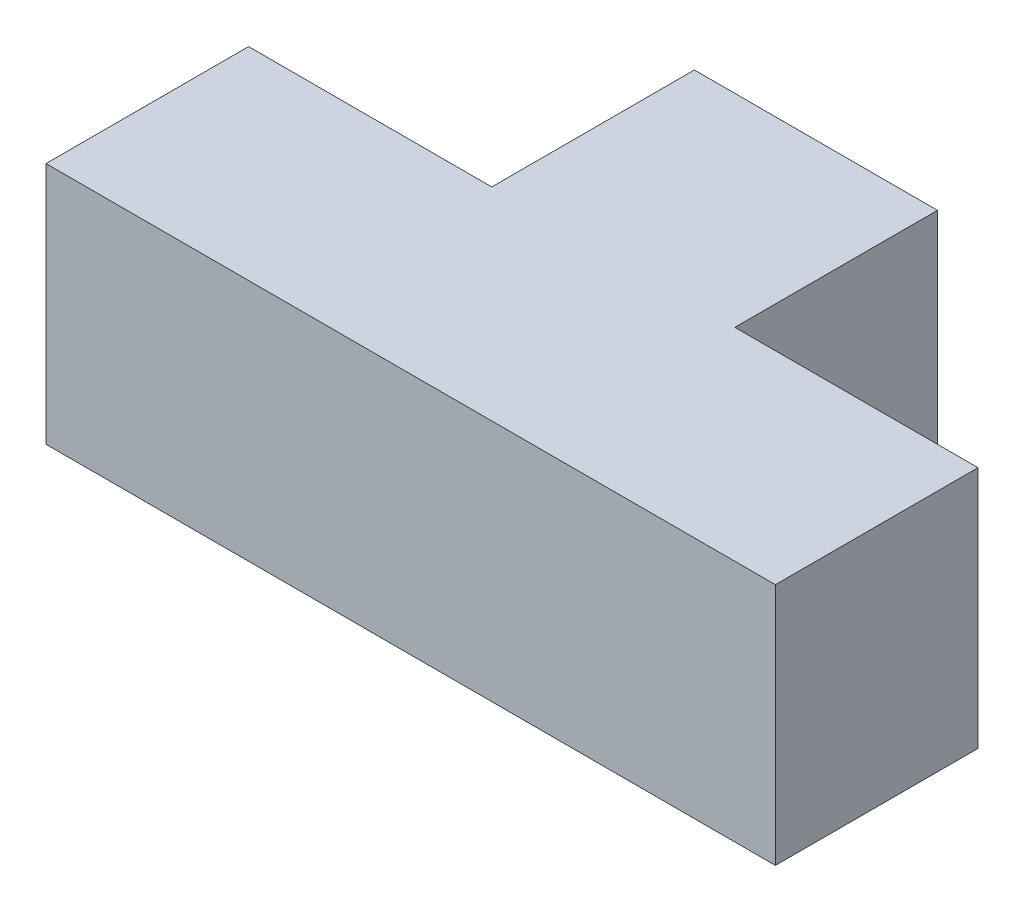
ISO-10303-21;
HEADER;
FILE_DESCRIPTION(('STEP AP214'),'2;1');
FILE_NAME('part.step','',(''),(''),'','','');
FILE_SCHEMA(('AUTOMOTIVE_DESIGN { 1 0 10303 214 1 1 1 1 }'));
ENDSEC;
DATA;
#1=APPLICATION_CONTEXT('core data for automotive mechanical design processes');
#2=APPLICATION_PROTOCOL_DEFINITION('international standard','automotive_design',2000,#1);
#3=PRODUCT_CONTEXT('',#1,'mechanical');
#4=PRODUCT('Part','Part','',(#3));
#5=PRODUCT_RELATED_PRODUCT_CATEGORY('part','',(#4));
#6=PRODUCT_DEFINITION_FORMATION('','',#4);
#7=PRODUCT_DEFINITION_CONTEXT('part definition',#1,'design');
#8=PRODUCT_DEFINITION('design','',#6,#7);
#9=PRODUCT_DEFINITION_SHAPE('','',#8);
#10=(LENGTH_UNIT() NAMED_UNIT(*) SI_UNIT(.MILLI.,.METRE.));
#11=(NAMED_UNIT(*) PLANE_ANGLE_UNIT() SI_UNIT($,.RADIAN.));
#12=(NAMED_UNIT(*) SI_UNIT($,.STERADIAN.) SOLID_ANGLE_UNIT());
#13=UNCERTAINTY_MEASURE_WITH_UNIT(LENGTH_MEASURE(1.E-05),#10,'distance_accuracy_value','');
#14=(GEOMETRIC_REPRESENTATION_CONTEXT(3) GLOBAL_UNCERTAINTY_ASSIGNED_CONTEXT((#13)) GLOBAL_UNIT_ASSIGNED_CONTEXT((#10,
#11,#12)) REPRESENTATION_CONTEXT('',''));
#15=CARTESIAN_POINT('',(0.,0.,0.));
#16=DIRECTION('',(0.,0.,1.));
#17=DIRECTION('',(1.,0.,0.));
#18=AXIS2_PLACEMENT_3D('',#15,#16,#17);
#19=CARTESIAN_POINT('',(0.,30.,0.));
#20=DIRECTION('',(-1.,0.,0.));
#21=DIRECTION('',(0.,0.,1.));
#22=AXIS2_PLACEMENT_3D('',#19,#20,#21);
#23=PLANE('',#22);
#24=DIRECTION('',(0.,0.,-1.));
#25=VECTOR('',#24,1.);
#26=CARTESIAN_POINT('',(0.,0.,0.));
#27=LINE('',#26,#25);
#28=CARTESIAN_POINT('',(0.,0.,0.));
#29=VERTEX_POINT('',#28);
#30=CARTESIAN_POINT('',(0.,0.,-25.));
#31=VERTEX_POINT('',#30);
#32=EDGE_CURVE('E131',#29,#31,#27,.T.);
#33=ORIENTED_EDGE('',*,*,#32,.T.);
#34=DIRECTION('',(0.,-1.,0.));
#35=VECTOR('',#34,1.);
#36=CARTESIAN_POINT('',(0.,30.,-25.));
#37=LINE('',#36,#35);
#38=CARTESIAN_POINT('',(0.,30.,-25.));
#39=VERTEX_POINT('',#38);
#40=EDGE_CURVE('E11',#39,#31,#37,.T.);
#41=ORIENTED_EDGE('',*,*,#40,.F.);
#42=DIRECTION('',(0.,0.,-1.));
#43=VECTOR('',#42,1.);
#44=CARTESIAN_POINT('',(0.,30.,0.));
#45=LINE('',#44,#43);
#46=CARTESIAN_POINT('',(0.,30.,0.));
#47=VERTEX_POINT('',#46);
#48=EDGE_CURVE('E145',#47,#39,#45,.T.);
#49=ORIENTED_EDGE('',*,*,#48,.F.);
#50=DIRECTION('',(0.,-1.,0.));
#51=VECTOR('',#50,1.);
#52=CARTESIAN_POINT('',(0.,30.,0.));
#53=LINE('',#52,#51);
#54=EDGE_CURVE('E127',#47,#29,#53,.T.);
#55=ORIENTED_EDGE('',*,*,#54,.T.);
#56=EDGE_LOOP('',(#33,#41,#49,#55));
#57=FACE_BOUND('',#56,.T.);
#58=ADVANCED_FACE('F35',(#57),#23,.F.);
#59=CARTESIAN_POINT('',(0.,30.,-25.));
#60=DIRECTION('',(0.,0.,1.));
#61=DIRECTION('',(1.,0.,0.));
#62=AXIS2_PLACEMENT_3D('',#59,#60,#61);
#63=PLANE('',#62);
#64=DIRECTION('',(-1.,0.,0.));
#65=VECTOR('',#64,1.);
#66=CARTESIAN_POINT('',(0.,0.,-25.));
#67=LINE('',#66,#65);
#68=CARTESIAN_POINT('',(-30.,0.,-25.));
#69=VERTEX_POINT('',#68);
#70=EDGE_CURVE('E134',#31,#69,#67,.T.);
#71=ORIENTED_EDGE('',*,*,#70,.T.);
#72=DIRECTION('',(0.,-1.,0.));
#73=VECTOR('',#72,1.);
#74=CARTESIAN_POINT('',(-30.,30.,-25.));
#75=LINE('',#74,#73);
#76=CARTESIAN_POINT('',(-30.,30.,-25.));
#77=VERTEX_POINT('',#76);
#78=EDGE_CURVE('E43',#77,#69,#75,.T.);
#79=ORIENTED_EDGE('',*,*,#78,.F.);
#80=DIRECTION('',(-1.,0.,0.));
#81=VECTOR('',#80,1.);
#82=CARTESIAN_POINT('',(0.,30.,-25.));
#83=LINE('',#82,#81);
#84=EDGE_CURVE('E94',#39,#77,#83,.T.);
#85=ORIENTED_EDGE('',*,*,#84,.F.);
#86=ORIENTED_EDGE('',*,*,#40,.T.);
#87=EDGE_LOOP('',(#71,#79,#85,#86));
#88=FACE_BOUND('',#87,.T.);
#89=ADVANCED_FACE('F180',(#88),#63,.F.);
#90=CARTESIAN_POINT('',(-30.,30.,-25.));
#91=DIRECTION('',(-1.,0.,0.));
#92=DIRECTION('',(0.,0.,1.));
#93=AXIS2_PLACEMENT_3D('',#90,#91,#92);
#94=PLANE('',#93);
#95=DIRECTION('',(0.,0.,-1.));
#96=VECTOR('',#95,1.);
#97=CARTESIAN_POINT('',(-30.,0.,-25.));
#98=LINE('',#97,#96);
#99=CARTESIAN_POINT('',(-30.,0.,-50.));
#100=VERTEX_POINT('',#99);
#101=EDGE_CURVE('E136',#69,#100,#98,.T.);
#102=ORIENTED_EDGE('',*,*,#101,.T.);
#103=DIRECTION('',(0.,-1.,0.));
#104=VECTOR('',#103,1.);
#105=CARTESIAN_POINT('',(-30.,30.,-50.));
#106=LINE('',#105,#104);
#107=CARTESIAN_POINT('',(-30.,30.,-50.));
#108=VERTEX_POINT('',#107);
#109=EDGE_CURVE('E152',#108,#100,#106,.T.);
#110=ORIENTED_EDGE('',*,*,#109,.F.);
#111=DIRECTION('',(0.,0.,-1.));
#112=VECTOR('',#111,1.);
#113=CARTESIAN_POINT('',(-30.,30.,-25.));
#114=LINE('',#113,#112);
#115=EDGE_CURVE('E160',#77,#108,#114,.T.);
#116=ORIENTED_EDGE('',*,*,#115,.F.);
#117=ORIENTED_EDGE('',*,*,#78,.T.);
#118=EDGE_LOOP('',(#102,#110,#116,#117));
#119=FACE_BOUND('',#118,.T.);
#120=ADVANCED_FACE('F158',(#119),#94,.F.);
#121=CARTESIAN_POINT('',(-30.,30.,-50.));
#122=DIRECTION('',(0.,0.,1.));
#123=DIRECTION('',(1.,0.,0.));
#124=AXIS2_PLACEMENT_3D('',#121,#122,#123);
#125=PLANE('',#124);
#126=DIRECTION('',(-1.,0.,0.));
#127=VECTOR('',#126,1.);
#128=CARTESIAN_POINT('',(-30.,0.,-50.));
#129=LINE('',#128,#127);
#130=CARTESIAN_POINT('',(-60.,0.,-50.));
#131=VERTEX_POINT('',#130);
#132=EDGE_CURVE('E138',#100,#131,#129,.T.);
#133=ORIENTED_EDGE('',*,*,#132,.T.);
#134=DIRECTION('',(0.,-1.,0.));
#135=VECTOR('',#134,1.);
#136=CARTESIAN_POINT('',(-60.,30.,-50.));
#137=LINE('',#136,#135);
#138=CARTESIAN_POINT('',(-60.,30.,-50.));
#139=VERTEX_POINT('',#138);
#140=EDGE_CURVE('E149',#139,#131,#137,.T.);
#141=ORIENTED_EDGE('',*,*,#140,.F.);
#142=DIRECTION('',(-1.,0.,0.));
#143=VECTOR('',#142,1.);
#144=CARTESIAN_POINT('',(-30.,30.,-50.));
#145=LINE('',#144,#143);
#146=EDGE_CURVE('E172',#108,#139,#145,.T.);
#147=ORIENTED_EDGE('',*,*,#146,.F.);
#148=ORIENTED_EDGE('',*,*,#109,.T.);
#149=EDGE_LOOP('',(#133,#141,#147,#148));
#150=FACE_BOUND('',#149,.T.);
#151=ADVANCED_FACE('F168',(#150),#125,.F.);
#152=CARTESIAN_POINT('',(-60.,30.,-25.));
#153=DIRECTION('',(1.,0.,0.));
#154=DIRECTION('',(0.,0.,-1.));
#155=AXIS2_PLACEMENT_3D('',#152,#153,#154);
#156=PLANE('',#155);
#157=DIRECTION('',(0.,0.,1.));
#158=VECTOR('',#157,1.);
#159=CARTESIAN_POINT('',(-60.,0.,-25.));
#160=LINE('',#159,#158);
#161=CARTESIAN_POINT('',(-60.,0.,-25.));
#162=VERTEX_POINT('',#161);
#163=EDGE_CURVE('E140',#131,#162,#160,.T.);
#164=ORIENTED_EDGE('',*,*,#163,.T.);
#165=DIRECTION('',(0.,-1.,0.));
#166=VECTOR('',#165,1.);
#167=CARTESIAN_POINT('',(-60.,30.,-25.));
#168=LINE('',#167,#166);
#169=CARTESIAN_POINT('',(-60.,30.,-25.));
#170=VERTEX_POINT('',#169);
#171=EDGE_CURVE('E122',#170,#162,#168,.T.);
#172=ORIENTED_EDGE('',*,*,#171,.F.);
#173=DIRECTION('',(0.,0.,1.));
#174=VECTOR('',#173,1.);
#175=CARTESIAN_POINT('',(-60.,30.,-25.));
#176=LINE('',#175,#174);
#177=EDGE_CURVE('E113',#139,#170,#176,.T.);
#178=ORIENTED_EDGE('',*,*,#177,.F.);
#179=ORIENTED_EDGE('',*,*,#140,.T.);
#180=EDGE_LOOP('',(#164,#172,#178,#179));
#181=FACE_BOUND('',#180,.T.);
#182=ADVANCED_FACE('F171',(#181),#156,.F.);
#183=CARTESIAN_POINT('',(-90.,30.,-25.));
#184=DIRECTION('',(0.,0.,1.));
#185=DIRECTION('',(1.,0.,0.));
#186=AXIS2_PLACEMENT_3D('',#183,#184,#185);
#187=PLANE('',#186);
#188=DIRECTION('',(-1.,0.,0.));
#189=VECTOR('',#188,1.);
#190=CARTESIAN_POINT('',(-90.,0.,-25.));
#191=LINE('',#190,#189);
#192=CARTESIAN_POINT('',(-90.,0.,-25.));
#193=VERTEX_POINT('',#192);
#194=EDGE_CURVE('E121',#162,#193,#191,.T.);
#195=ORIENTED_EDGE('',*,*,#194,.T.);
#196=DIRECTION('',(0.,-1.,0.));
#197=VECTOR('',#196,1.);
#198=CARTESIAN_POINT('',(-90.,30.,-25.));
#199=LINE('',#198,#197);
#200=CARTESIAN_POINT('',(-90.,30.,-25.));
#201=VERTEX_POINT('',#200);
#202=EDGE_CURVE('E118',#201,#193,#199,.T.);
#203=ORIENTED_EDGE('',*,*,#202,.F.);
#204=DIRECTION('',(-1.,0.,0.));
#205=VECTOR('',#204,1.);
#206=CARTESIAN_POINT('',(-90.,30.,-25.));
#207=LINE('',#206,#205);
#208=EDGE_CURVE('E107',#170,#201,#207,.T.);
#209=ORIENTED_EDGE('',*,*,#208,.F.);
#210=ORIENTED_EDGE('',*,*,#171,.T.);
#211=EDGE_LOOP('',(#195,#203,#209,#210));
#212=FACE_BOUND('',#211,.T.);
#213=ADVANCED_FACE('F119',(#212),#187,.F.);
#214=CARTESIAN_POINT('',(-90.,30.,0.));
#215=DIRECTION('',(1.,0.,0.));
#216=DIRECTION('',(0.,0.,-1.));
#217=AXIS2_PLACEMENT_3D('',#214,#215,#216);
#218=PLANE('',#217);
#219=DIRECTION('',(0.,0.,1.));
#220=VECTOR('',#219,1.);
#221=CARTESIAN_POINT('',(-90.,0.,0.));
#222=LINE('',#221,#220);
#223=CARTESIAN_POINT('',(-90.,0.,0.));
#224=VERTEX_POINT('',#223);
#225=EDGE_CURVE('E80',#193,#224,#222,.T.);
#226=ORIENTED_EDGE('',*,*,#225,.T.);
#227=DIRECTION('',(0.,-1.,0.));
#228=VECTOR('',#227,1.);
#229=CARTESIAN_POINT('',(-90.,30.,0.));
#230=LINE('',#229,#228);
#231=CARTESIAN_POINT('',(-90.,30.,0.));
#232=VERTEX_POINT('',#231);
#233=EDGE_CURVE('E123',#232,#224,#230,.T.);
#234=ORIENTED_EDGE('',*,*,#233,.F.);
#235=DIRECTION('',(0.,0.,1.));
#236=VECTOR('',#235,1.);
#237=CARTESIAN_POINT('',(-90.,30.,0.));
#238=LINE('',#237,#236);
#239=EDGE_CURVE('E111',#201,#232,#238,.T.);
#240=ORIENTED_EDGE('',*,*,#239,.F.);
#241=ORIENTED_EDGE('',*,*,#202,.T.);
#242=EDGE_LOOP('',(#226,#234,#240,#241));
#243=FACE_BOUND('',#242,.T.);
#244=ADVANCED_FACE('F125',(#243),#218,.F.);
#245=CARTESIAN_POINT('',(0.,30.,0.));
#246=DIRECTION('',(0.,0.,-1.));
#247=DIRECTION('',(-1.,0.,0.));
#248=AXIS2_PLACEMENT_3D('',#245,#246,#247);
#249=PLANE('',#248);
#250=DIRECTION('',(1.,0.,0.));
#251=VECTOR('',#250,1.);
#252=CARTESIAN_POINT('',(0.,0.,0.));
#253=LINE('',#252,#251);
#254=EDGE_CURVE('E86',#224,#29,#253,.T.);
#255=ORIENTED_EDGE('',*,*,#254,.T.);
#256=ORIENTED_EDGE('',*,*,#54,.F.);
#257=DIRECTION('',(1.,0.,0.));
#258=VECTOR('',#257,1.);
#259=CARTESIAN_POINT('',(0.,30.,0.));
#260=LINE('',#259,#258);
#261=EDGE_CURVE('E51',#232,#47,#260,.T.);
#262=ORIENTED_EDGE('',*,*,#261,.F.);
#263=ORIENTED_EDGE('',*,*,#233,.T.);
#264=EDGE_LOOP('',(#255,#256,#262,#263));
#265=FACE_BOUND('',#264,.T.);
#266=ADVANCED_FACE('F196',(#265),#249,.F.);
#267=CARTESIAN_POINT('',(0.,30.,0.));
#268=DIRECTION('',(0.,1.,0.));
#269=DIRECTION('',(0.,0.,1.));
#270=AXIS2_PLACEMENT_3D('',#267,#268,#269);
#271=PLANE('',#270);
#272=ORIENTED_EDGE('',*,*,#48,.T.);
#273=ORIENTED_EDGE('',*,*,#84,.T.);
#274=ORIENTED_EDGE('',*,*,#115,.T.);
#275=ORIENTED_EDGE('',*,*,#146,.T.);
#276=ORIENTED_EDGE('',*,*,#177,.T.);
#277=ORIENTED_EDGE('',*,*,#208,.T.);
#278=ORIENTED_EDGE('',*,*,#239,.T.);
#279=ORIENTED_EDGE('',*,*,#261,.T.);
#280=EDGE_LOOP('',(#272,#273,#274,#275,#276,#277,#278,#279));
#281=FACE_BOUND('',#280,.T.);
#282=ADVANCED_FACE('F109',(#281),#271,.T.);
#283=CARTESIAN_POINT('',(0.,0.,0.));
#284=DIRECTION('',(0.,1.,0.));
#285=DIRECTION('',(0.,0.,1.));
#286=AXIS2_PLACEMENT_3D('',#283,#284,#285);
#287=PLANE('',#286);
#288=ORIENTED_EDGE('',*,*,#32,.F.);
#289=ORIENTED_EDGE('',*,*,#254,.F.);
#290=ORIENTED_EDGE('',*,*,#225,.F.);
#291=ORIENTED_EDGE('',*,*,#194,.F.);
#292=ORIENTED_EDGE('',*,*,#163,.F.);
#293=ORIENTED_EDGE('',*,*,#132,.F.);
#294=ORIENTED_EDGE('',*,*,#101,.F.);
#295=ORIENTED_EDGE('',*,*,#70,.F.);
#296=EDGE_LOOP('',(#288,#289,#290,#291,#292,#293,#294,#295));
#297=FACE_BOUND('',#296,.T.);
#298=ADVANCED_FACE('F164',(#297),#287,.F.);
#299=CLOSED_SHELL('',(#58,#89,#120,#151,#182,#213,#244,#266,#282,#298));
#300=MANIFOLD_SOLID_BREP('B2',#299);
#301=ADVANCED_BREP_SHAPE_REPRESENTATION('',(#18,#300),#14);
#302=SHAPE_DEFINITION_REPRESENTATION(#9,#301);
ENDSEC;
END-ISO-10303-21;
